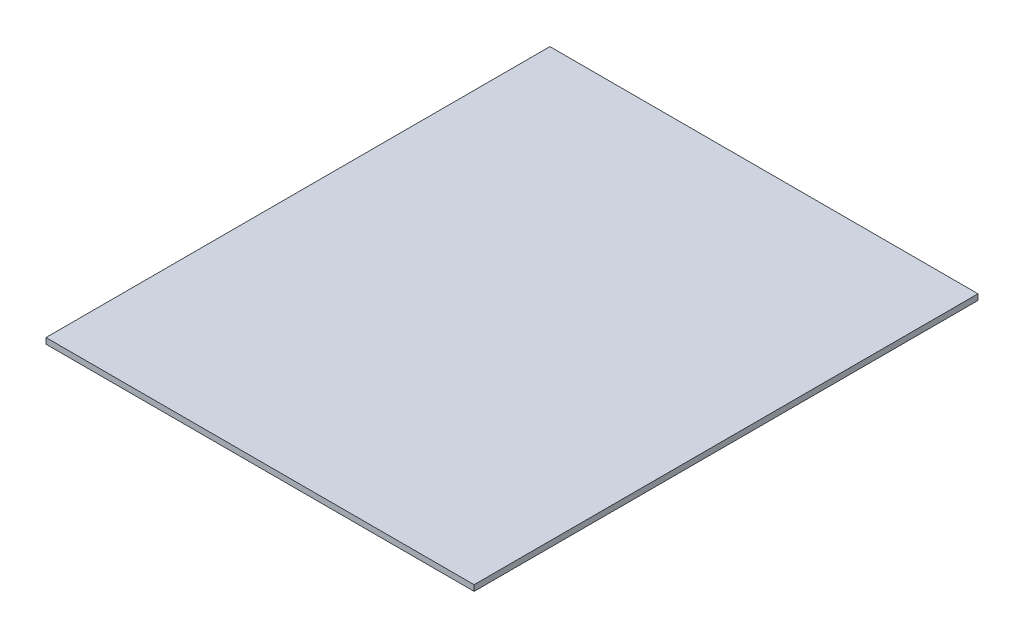
ISO-10303-21;
HEADER;
FILE_DESCRIPTION(('STEP AP214'),'2;1');
FILE_NAME('part.step','',(''),(''),'','','');
FILE_SCHEMA(('AUTOMOTIVE_DESIGN { 1 0 10303 214 1 1 1 1 }'));
ENDSEC;
DATA;
#1=APPLICATION_CONTEXT('core data for automotive mechanical design processes');
#2=APPLICATION_PROTOCOL_DEFINITION('international standard','automotive_design',2000,#1);
#3=PRODUCT_CONTEXT('',#1,'mechanical');
#4=PRODUCT('Part','Part','',(#3));
#5=PRODUCT_RELATED_PRODUCT_CATEGORY('part','',(#4));
#6=PRODUCT_DEFINITION_FORMATION('','',#4);
#7=PRODUCT_DEFINITION_CONTEXT('part definition',#1,'design');
#8=PRODUCT_DEFINITION('design','',#6,#7);
#9=PRODUCT_DEFINITION_SHAPE('','',#8);
#10=(LENGTH_UNIT() NAMED_UNIT(*) SI_UNIT(.MILLI.,.METRE.));
#11=(NAMED_UNIT(*) PLANE_ANGLE_UNIT() SI_UNIT($,.RADIAN.));
#12=(NAMED_UNIT(*) SI_UNIT($,.STERADIAN.) SOLID_ANGLE_UNIT());
#13=UNCERTAINTY_MEASURE_WITH_UNIT(LENGTH_MEASURE(1.E-05),#10,'distance_accuracy_value','');
#14=(GEOMETRIC_REPRESENTATION_CONTEXT(3) GLOBAL_UNCERTAINTY_ASSIGNED_CONTEXT((#13)) GLOBAL_UNIT_ASSIGNED_CONTEXT((#10,
#11,#12)) REPRESENTATION_CONTEXT('',''));
#15=CARTESIAN_POINT('',(0.,0.,0.));
#16=DIRECTION('',(0.,0.,1.));
#17=DIRECTION('',(1.,0.,0.));
#18=AXIS2_PLACEMENT_3D('',#15,#16,#17);
#19=CARTESIAN_POINT('',(-110.5,333.,134.624897978768));
#20=DIRECTION('',(1.,0.,0.));
#21=DIRECTION('',(0.,0.,-1.));
#22=AXIS2_PLACEMENT_3D('',#19,#20,#21);
#23=PLANE('',#22);
#24=DIRECTION('',(0.,0.,1.));
#25=VECTOR('',#24,1.);
#26=CARTESIAN_POINT('',(-110.5,330.,134.624897978768));
#27=LINE('',#26,#25);
#28=CARTESIAN_POINT('',(-110.5,330.,-125.5));
#29=VERTEX_POINT('',#28);
#30=CARTESIAN_POINT('',(-110.5,330.,134.624897978768));
#31=VERTEX_POINT('',#30);
#32=EDGE_CURVE('E96',#29,#31,#27,.T.);
#33=ORIENTED_EDGE('',*,*,#32,.T.);
#34=DIRECTION('',(0.,-1.,0.));
#35=VECTOR('',#34,1.);
#36=CARTESIAN_POINT('',(-110.5,333.,134.624897978768));
#37=LINE('',#36,#35);
#38=CARTESIAN_POINT('',(-110.5,333.,134.624897978768));
#39=VERTEX_POINT('',#38);
#40=EDGE_CURVE('E11',#39,#31,#37,.T.);
#41=ORIENTED_EDGE('',*,*,#40,.F.);
#42=DIRECTION('',(0.,0.,1.));
#43=VECTOR('',#42,1.);
#44=CARTESIAN_POINT('',(-110.5,333.,134.624897978768));
#45=LINE('',#44,#43);
#46=CARTESIAN_POINT('',(-110.5,333.,-125.5));
#47=VERTEX_POINT('',#46);
#48=EDGE_CURVE('E84',#47,#39,#45,.T.);
#49=ORIENTED_EDGE('',*,*,#48,.F.);
#50=DIRECTION('',(0.,-1.,0.));
#51=VECTOR('',#50,1.);
#52=CARTESIAN_POINT('',(-110.5,333.,-125.5));
#53=LINE('',#52,#51);
#54=EDGE_CURVE('E92',#47,#29,#53,.T.);
#55=ORIENTED_EDGE('',*,*,#54,.T.);
#56=EDGE_LOOP('',(#33,#41,#49,#55));
#57=FACE_BOUND('',#56,.T.);
#58=ADVANCED_FACE('F33',(#57),#23,.F.);
#59=CARTESIAN_POINT('',(110.5,333.,134.624897978768));
#60=DIRECTION('',(0.,0.,-1.));
#61=DIRECTION('',(-1.,0.,0.));
#62=AXIS2_PLACEMENT_3D('',#59,#60,#61);
#63=PLANE('',#62);
#64=DIRECTION('',(1.,0.,0.));
#65=VECTOR('',#64,1.);
#66=CARTESIAN_POINT('',(110.5,330.,134.624897978768));
#67=LINE('',#66,#65);
#68=CARTESIAN_POINT('',(110.5,330.,134.624897978768));
#69=VERTEX_POINT('',#68);
#70=EDGE_CURVE('E88',#31,#69,#67,.T.);
#71=ORIENTED_EDGE('',*,*,#70,.T.);
#72=DIRECTION('',(0.,-1.,0.));
#73=VECTOR('',#72,1.);
#74=CARTESIAN_POINT('',(110.5,333.,134.624897978768));
#75=LINE('',#74,#73);
#76=CARTESIAN_POINT('',(110.5,333.,134.624897978768));
#77=VERTEX_POINT('',#76);
#78=EDGE_CURVE('E41',#77,#69,#75,.T.);
#79=ORIENTED_EDGE('',*,*,#78,.F.);
#80=DIRECTION('',(1.,0.,0.));
#81=VECTOR('',#80,1.);
#82=CARTESIAN_POINT('',(110.5,333.,134.624897978768));
#83=LINE('',#82,#81);
#84=EDGE_CURVE('E79',#39,#77,#83,.T.);
#85=ORIENTED_EDGE('',*,*,#84,.F.);
#86=ORIENTED_EDGE('',*,*,#40,.T.);
#87=EDGE_LOOP('',(#71,#79,#85,#86));
#88=FACE_BOUND('',#87,.T.);
#89=ADVANCED_FACE('F87',(#88),#63,.F.);
#90=CARTESIAN_POINT('',(110.5,333.,-125.5));
#91=DIRECTION('',(-1.,0.,0.));
#92=DIRECTION('',(0.,0.,1.));
#93=AXIS2_PLACEMENT_3D('',#90,#91,#92);
#94=PLANE('',#93);
#95=DIRECTION('',(0.,0.,-1.));
#96=VECTOR('',#95,1.);
#97=CARTESIAN_POINT('',(110.5,330.,-125.5));
#98=LINE('',#97,#96);
#99=CARTESIAN_POINT('',(110.5,330.,-125.5));
#100=VERTEX_POINT('',#99);
#101=EDGE_CURVE('E66',#69,#100,#98,.T.);
#102=ORIENTED_EDGE('',*,*,#101,.T.);
#103=DIRECTION('',(0.,-1.,0.));
#104=VECTOR('',#103,1.);
#105=CARTESIAN_POINT('',(110.5,333.,-125.5));
#106=LINE('',#105,#104);
#107=CARTESIAN_POINT('',(110.5,333.,-125.5));
#108=VERTEX_POINT('',#107);
#109=EDGE_CURVE('E89',#108,#100,#106,.T.);
#110=ORIENTED_EDGE('',*,*,#109,.F.);
#111=DIRECTION('',(0.,0.,-1.));
#112=VECTOR('',#111,1.);
#113=CARTESIAN_POINT('',(110.5,333.,-125.5));
#114=LINE('',#113,#112);
#115=EDGE_CURVE('E82',#77,#108,#114,.T.);
#116=ORIENTED_EDGE('',*,*,#115,.F.);
#117=ORIENTED_EDGE('',*,*,#78,.T.);
#118=EDGE_LOOP('',(#102,#110,#116,#117));
#119=FACE_BOUND('',#118,.T.);
#120=ADVANCED_FACE('F90',(#119),#94,.F.);
#121=CARTESIAN_POINT('',(-110.5,333.,-125.5));
#122=DIRECTION('',(0.,0.,1.));
#123=DIRECTION('',(1.,0.,0.));
#124=AXIS2_PLACEMENT_3D('',#121,#122,#123);
#125=PLANE('',#124);
#126=DIRECTION('',(-1.,0.,0.));
#127=VECTOR('',#126,1.);
#128=CARTESIAN_POINT('',(-110.5,330.,-125.5));
#129=LINE('',#128,#127);
#130=EDGE_CURVE('E72',#100,#29,#129,.T.);
#131=ORIENTED_EDGE('',*,*,#130,.T.);
#132=ORIENTED_EDGE('',*,*,#54,.F.);
#133=DIRECTION('',(-1.,0.,0.));
#134=VECTOR('',#133,1.);
#135=CARTESIAN_POINT('',(-110.5,333.,-125.5));
#136=LINE('',#135,#134);
#137=EDGE_CURVE('E49',#108,#47,#136,.T.);
#138=ORIENTED_EDGE('',*,*,#137,.F.);
#139=ORIENTED_EDGE('',*,*,#109,.T.);
#140=EDGE_LOOP('',(#131,#132,#138,#139));
#141=FACE_BOUND('',#140,.T.);
#142=ADVANCED_FACE('F103',(#141),#125,.F.);
#143=CARTESIAN_POINT('',(0.,333.,0.));
#144=DIRECTION('',(0.,-1.,0.));
#145=DIRECTION('',(0.,0.,-1.));
#146=AXIS2_PLACEMENT_3D('',#143,#144,#145);
#147=PLANE('',#146);
#148=ORIENTED_EDGE('',*,*,#48,.T.);
#149=ORIENTED_EDGE('',*,*,#84,.T.);
#150=ORIENTED_EDGE('',*,*,#115,.T.);
#151=ORIENTED_EDGE('',*,*,#137,.T.);
#152=EDGE_LOOP('',(#148,#149,#150,#151));
#153=FACE_BOUND('',#152,.T.);
#154=ADVANCED_FACE('F80',(#153),#147,.F.);
#155=CARTESIAN_POINT('',(0.,330.,0.));
#156=DIRECTION('',(0.,-1.,0.));
#157=DIRECTION('',(0.,0.,-1.));
#158=AXIS2_PLACEMENT_3D('',#155,#156,#157);
#159=PLANE('',#158);
#160=ORIENTED_EDGE('',*,*,#32,.F.);
#161=ORIENTED_EDGE('',*,*,#130,.F.);
#162=ORIENTED_EDGE('',*,*,#101,.F.);
#163=ORIENTED_EDGE('',*,*,#70,.F.);
#164=EDGE_LOOP('',(#160,#161,#162,#163));
#165=FACE_BOUND('',#164,.T.);
#166=ADVANCED_FACE('F106',(#165),#159,.T.);
#167=CLOSED_SHELL('',(#58,#89,#120,#142,#154,#166));
#168=MANIFOLD_SOLID_BREP('B2',#167);
#169=ADVANCED_BREP_SHAPE_REPRESENTATION('',(#18,#168),#14);
#170=SHAPE_DEFINITION_REPRESENTATION(#9,#169);
ENDSEC;
END-ISO-10303-21;
